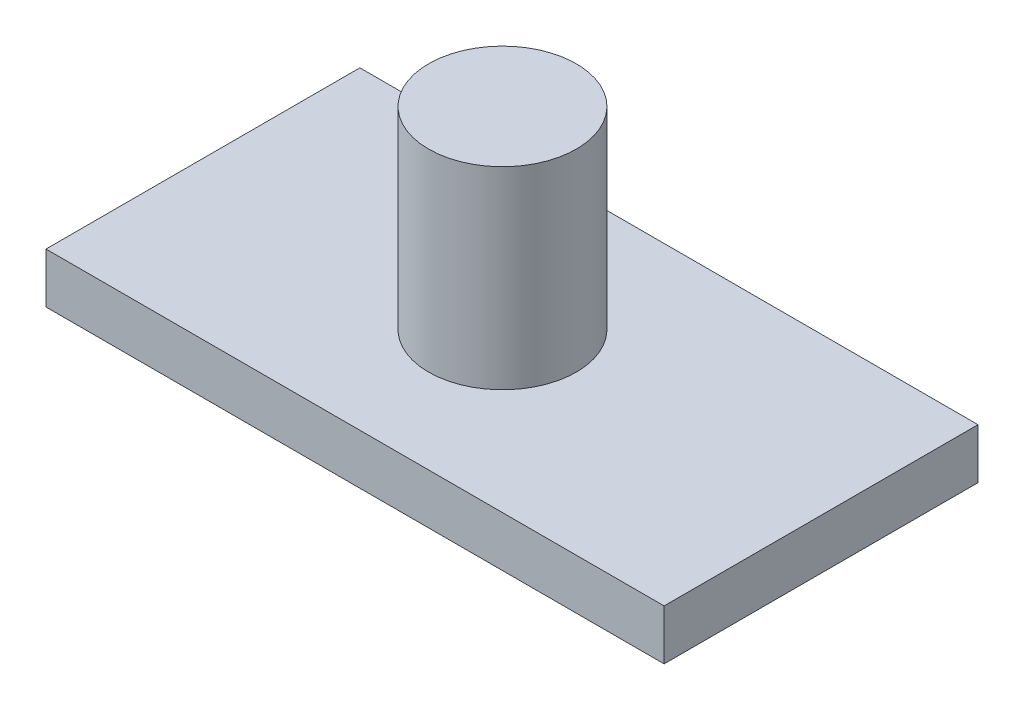
ISO-10303-21;
HEADER;
FILE_DESCRIPTION(('STEP AP214'),'2;1');
FILE_NAME('part.step','',(''),(''),'','','');
FILE_SCHEMA(('AUTOMOTIVE_DESIGN { 1 0 10303 214 1 1 1 1 }'));
ENDSEC;
DATA;
#1=APPLICATION_CONTEXT('core data for automotive mechanical design processes');
#2=APPLICATION_PROTOCOL_DEFINITION('international standard','automotive_design',2000,#1);
#3=PRODUCT_CONTEXT('',#1,'mechanical');
#4=PRODUCT('Part','Part','',(#3));
#5=PRODUCT_RELATED_PRODUCT_CATEGORY('part','',(#4));
#6=PRODUCT_DEFINITION_FORMATION('','',#4);
#7=PRODUCT_DEFINITION_CONTEXT('part definition',#1,'design');
#8=PRODUCT_DEFINITION('design','',#6,#7);
#9=PRODUCT_DEFINITION_SHAPE('','',#8);
#10=(LENGTH_UNIT() NAMED_UNIT(*) SI_UNIT(.MILLI.,.METRE.));
#11=(NAMED_UNIT(*) PLANE_ANGLE_UNIT() SI_UNIT($,.RADIAN.));
#12=(NAMED_UNIT(*) SI_UNIT($,.STERADIAN.) SOLID_ANGLE_UNIT());
#13=UNCERTAINTY_MEASURE_WITH_UNIT(LENGTH_MEASURE(1.E-05),#10,'distance_accuracy_value','');
#14=(GEOMETRIC_REPRESENTATION_CONTEXT(3) GLOBAL_UNCERTAINTY_ASSIGNED_CONTEXT((#13)) GLOBAL_UNIT_ASSIGNED_CONTEXT((#10,
#11,#12)) REPRESENTATION_CONTEXT('',''));
#15=CARTESIAN_POINT('',(0.,0.,0.));
#16=DIRECTION('',(0.,0.,1.));
#17=DIRECTION('',(1.,0.,0.));
#18=AXIS2_PLACEMENT_3D('',#15,#16,#17);
#19=CARTESIAN_POINT('',(0.,6.604,0.));
#20=DIRECTION('',(1.,0.,0.));
#21=DIRECTION('',(0.,0.,-1.));
#22=AXIS2_PLACEMENT_3D('',#19,#20,#21);
#23=PLANE('',#22);
#24=DIRECTION('',(0.,0.,1.));
#25=VECTOR('',#24,1.);
#26=CARTESIAN_POINT('',(0.,0.,0.));
#27=LINE('',#26,#25);
#28=CARTESIAN_POINT('',(0.,0.,0.));
#29=VERTEX_POINT('',#28);
#30=CARTESIAN_POINT('',(0.,0.,41.275));
#31=VERTEX_POINT('',#30);
#32=EDGE_CURVE('E99',#29,#31,#27,.T.);
#33=ORIENTED_EDGE('',*,*,#32,.T.);
#34=DIRECTION('',(0.,-1.,0.));
#35=VECTOR('',#34,1.);
#36=CARTESIAN_POINT('',(0.,6.604,41.275));
#37=LINE('',#36,#35);
#38=CARTESIAN_POINT('',(0.,6.604,41.275));
#39=VERTEX_POINT('',#38);
#40=EDGE_CURVE('E36',#39,#31,#37,.T.);
#41=ORIENTED_EDGE('',*,*,#40,.F.);
#42=DIRECTION('',(0.,0.,1.));
#43=VECTOR('',#42,1.);
#44=CARTESIAN_POINT('',(0.,6.604,0.));
#45=LINE('',#44,#43);
#46=CARTESIAN_POINT('',(0.,6.604,0.));
#47=VERTEX_POINT('',#46);
#48=EDGE_CURVE('E86',#47,#39,#45,.T.);
#49=ORIENTED_EDGE('',*,*,#48,.F.);
#50=DIRECTION('',(0.,-1.,0.));
#51=VECTOR('',#50,1.);
#52=CARTESIAN_POINT('',(0.,6.604,0.));
#53=LINE('',#52,#51);
#54=EDGE_CURVE('E95',#47,#29,#53,.T.);
#55=ORIENTED_EDGE('',*,*,#54,.T.);
#56=EDGE_LOOP('',(#33,#41,#49,#55));
#57=FACE_BOUND('',#56,.T.);
#58=ADVANCED_FACE('F33',(#57),#23,.F.);
#59=CARTESIAN_POINT('',(0.,6.604,41.275));
#60=DIRECTION('',(0.,0.,-1.));
#61=DIRECTION('',(-1.,0.,0.));
#62=AXIS2_PLACEMENT_3D('',#59,#60,#61);
#63=PLANE('',#62);
#64=DIRECTION('',(1.,0.,0.));
#65=VECTOR('',#64,1.);
#66=CARTESIAN_POINT('',(0.,0.,41.275));
#67=LINE('',#66,#65);
#68=CARTESIAN_POINT('',(81.28,0.,41.275));
#69=VERTEX_POINT('',#68);
#70=EDGE_CURVE('E91',#31,#69,#67,.T.);
#71=ORIENTED_EDGE('',*,*,#70,.T.);
#72=DIRECTION('',(0.,-1.,0.));
#73=VECTOR('',#72,1.);
#74=CARTESIAN_POINT('',(81.28,6.604,41.275));
#75=LINE('',#74,#73);
#76=CARTESIAN_POINT('',(81.28,6.604,41.275));
#77=VERTEX_POINT('',#76);
#78=EDGE_CURVE('E89',#77,#69,#75,.T.);
#79=ORIENTED_EDGE('',*,*,#78,.F.);
#80=DIRECTION('',(1.,0.,0.));
#81=VECTOR('',#80,1.);
#82=CARTESIAN_POINT('',(0.,6.604,41.275));
#83=LINE('',#82,#81);
#84=EDGE_CURVE('E81',#39,#77,#83,.T.);
#85=ORIENTED_EDGE('',*,*,#84,.F.);
#86=ORIENTED_EDGE('',*,*,#40,.T.);
#87=EDGE_LOOP('',(#71,#79,#85,#86));
#88=FACE_BOUND('',#87,.T.);
#89=ADVANCED_FACE('F90',(#88),#63,.F.);
#90=CARTESIAN_POINT('',(81.28,6.604,0.));
#91=DIRECTION('',(-1.,0.,0.));
#92=DIRECTION('',(0.,0.,1.));
#93=AXIS2_PLACEMENT_3D('',#90,#91,#92);
#94=PLANE('',#93);
#95=DIRECTION('',(0.,0.,-1.));
#96=VECTOR('',#95,1.);
#97=CARTESIAN_POINT('',(81.28,0.,0.));
#98=LINE('',#97,#96);
#99=CARTESIAN_POINT('',(81.28,0.,0.));
#100=VERTEX_POINT('',#99);
#101=EDGE_CURVE('E67',#69,#100,#98,.T.);
#102=ORIENTED_EDGE('',*,*,#101,.T.);
#103=DIRECTION('',(0.,-1.,0.));
#104=VECTOR('',#103,1.);
#105=CARTESIAN_POINT('',(81.28,6.604,0.));
#106=LINE('',#105,#104);
#107=CARTESIAN_POINT('',(81.28,6.604,0.));
#108=VERTEX_POINT('',#107);
#109=EDGE_CURVE('E92',#108,#100,#106,.T.);
#110=ORIENTED_EDGE('',*,*,#109,.F.);
#111=DIRECTION('',(0.,0.,-1.));
#112=VECTOR('',#111,1.);
#113=CARTESIAN_POINT('',(81.28,6.604,0.));
#114=LINE('',#113,#112);
#115=EDGE_CURVE('E84',#77,#108,#114,.T.);
#116=ORIENTED_EDGE('',*,*,#115,.F.);
#117=ORIENTED_EDGE('',*,*,#78,.T.);
#118=EDGE_LOOP('',(#102,#110,#116,#117));
#119=FACE_BOUND('',#118,.T.);
#120=ADVANCED_FACE('F93',(#119),#94,.F.);
#121=CARTESIAN_POINT('',(0.,6.604,0.));
#122=DIRECTION('',(0.,0.,1.));
#123=DIRECTION('',(1.,0.,0.));
#124=AXIS2_PLACEMENT_3D('',#121,#122,#123);
#125=PLANE('',#124);
#126=DIRECTION('',(-1.,0.,0.));
#127=VECTOR('',#126,1.);
#128=CARTESIAN_POINT('',(0.,0.,0.));
#129=LINE('',#128,#127);
#130=EDGE_CURVE('E73',#100,#29,#129,.T.);
#131=ORIENTED_EDGE('',*,*,#130,.T.);
#132=ORIENTED_EDGE('',*,*,#54,.F.);
#133=DIRECTION('',(-1.,0.,0.));
#134=VECTOR('',#133,1.);
#135=CARTESIAN_POINT('',(0.,6.604,0.));
#136=LINE('',#135,#134);
#137=EDGE_CURVE('E50',#108,#47,#136,.T.);
#138=ORIENTED_EDGE('',*,*,#137,.F.);
#139=ORIENTED_EDGE('',*,*,#109,.T.);
#140=EDGE_LOOP('',(#131,#132,#138,#139));
#141=FACE_BOUND('',#140,.T.);
#142=ADVANCED_FACE('F107',(#141),#125,.F.);
#143=CARTESIAN_POINT('',(0.,6.604,0.));
#144=DIRECTION('',(0.,1.,0.));
#145=DIRECTION('',(0.,0.,1.));
#146=AXIS2_PLACEMENT_3D('',#143,#144,#145);
#147=PLANE('',#146);
#148=CARTESIAN_POINT('',(39.1715485946096,6.604,20.4215512639131));
#149=DIRECTION('',(0.,1.,0.));
#150=DIRECTION('',(0.,0.,1.));
#151=AXIS2_PLACEMENT_3D('',#148,#149,#150);
#152=CIRCLE('',#151,9.71644533998887);
#153=CARTESIAN_POINT('',(39.1715485946096,6.604,30.137996603902));
#154=VERTEX_POINT('',#153);
#155=EDGE_CURVE('E11',#154,#154,#152,.T.);
#156=ORIENTED_EDGE('',*,*,#155,.F.);
#157=EDGE_LOOP('',(#156));
#158=FACE_BOUND('',#157,.T.);
#159=ORIENTED_EDGE('',*,*,#48,.T.);
#160=ORIENTED_EDGE('',*,*,#84,.T.);
#161=ORIENTED_EDGE('',*,*,#115,.T.);
#162=ORIENTED_EDGE('',*,*,#137,.T.);
#163=EDGE_LOOP('',(#159,#160,#161,#162));
#164=FACE_BOUND('',#163,.T.);
#165=ADVANCED_FACE('F82',(#158,#164),#147,.T.);
#166=CARTESIAN_POINT('',(0.,0.,0.));
#167=DIRECTION('',(0.,1.,0.));
#168=DIRECTION('',(0.,0.,1.));
#169=AXIS2_PLACEMENT_3D('',#166,#167,#168);
#170=PLANE('',#169);
#171=ORIENTED_EDGE('',*,*,#32,.F.);
#172=ORIENTED_EDGE('',*,*,#130,.F.);
#173=ORIENTED_EDGE('',*,*,#101,.F.);
#174=ORIENTED_EDGE('',*,*,#70,.F.);
#175=EDGE_LOOP('',(#171,#172,#173,#174));
#176=FACE_BOUND('',#175,.T.);
#177=ADVANCED_FACE('F110',(#176),#170,.F.);
#178=CARTESIAN_POINT('',(39.1715485946096,32.004,20.4215512639131));
#179=DIRECTION('',(0.,-1.,0.));
#180=DIRECTION('',(0.,0.,-1.));
#181=AXIS2_PLACEMENT_3D('',#178,#179,#180);
#182=CYLINDRICAL_SURFACE('',#181,9.71644533998887);
#183=CARTESIAN_POINT('',(39.1715485946096,32.004,20.4215512639131));
#184=DIRECTION('',(0.,1.,0.));
#185=DIRECTION('',(0.,0.,1.));
#186=AXIS2_PLACEMENT_3D('',#183,#184,#185);
#187=CIRCLE('',#186,9.71644533998887);
#188=CARTESIAN_POINT('',(39.1715485946096,32.004,30.137996603902));
#189=VERTEX_POINT('',#188);
#190=EDGE_CURVE('E102',#189,#189,#187,.T.);
#191=ORIENTED_EDGE('',*,*,#190,.F.);
#192=EDGE_LOOP('',(#191));
#193=FACE_BOUND('',#192,.T.);
#194=ORIENTED_EDGE('',*,*,#155,.T.);
#195=EDGE_LOOP('',(#194));
#196=FACE_BOUND('',#195,.T.);
#197=ADVANCED_FACE('F118',(#193,#196),#182,.T.);
#198=CARTESIAN_POINT('',(39.1715485946096,32.004,20.4215512639131));
#199=DIRECTION('',(0.,1.,0.));
#200=DIRECTION('',(0.,0.,1.));
#201=AXIS2_PLACEMENT_3D('',#198,#199,#200);
#202=PLANE('',#201);
#203=ORIENTED_EDGE('',*,*,#190,.T.);
#204=EDGE_LOOP('',(#203));
#205=FACE_BOUND('',#204,.T.);
#206=ADVANCED_FACE('F116',(#205),#202,.T.);
#207=CLOSED_SHELL('',(#58,#89,#120,#142,#165,#177,#197,#206));
#208=MANIFOLD_SOLID_BREP('B2',#207);
#209=ADVANCED_BREP_SHAPE_REPRESENTATION('',(#18,#208),#14);
#210=SHAPE_DEFINITION_REPRESENTATION(#9,#209);
ENDSEC;
END-ISO-10303-21;
